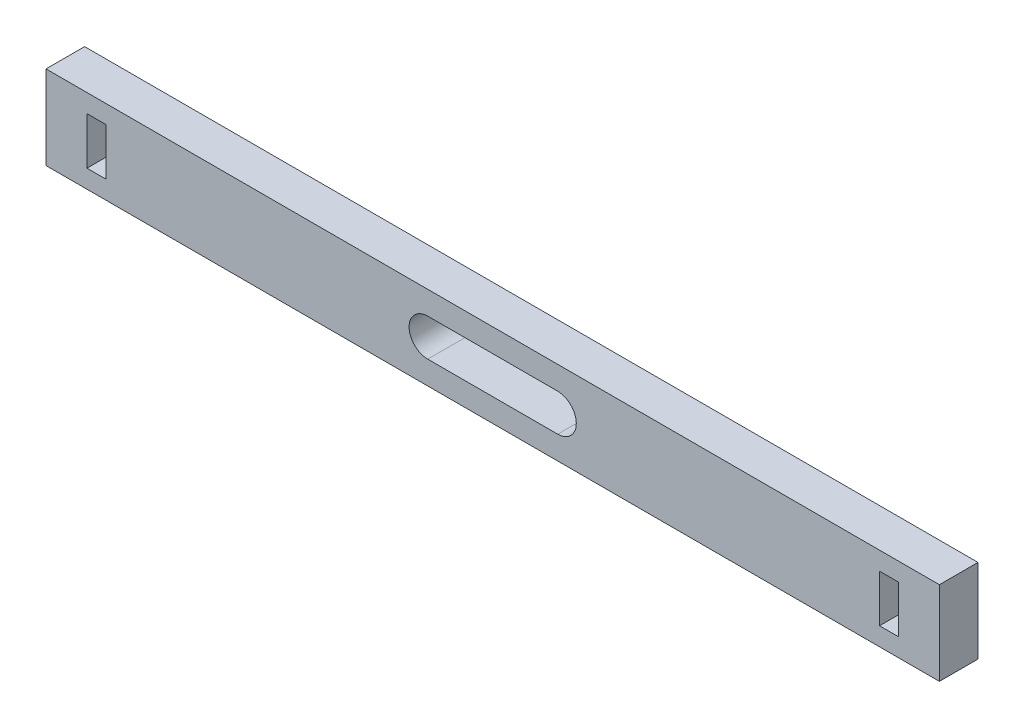
ISO-10303-21;
HEADER;
FILE_DESCRIPTION(('STEP AP214'),'2;1');
FILE_NAME('part.step','',(''),(''),'','','');
FILE_SCHEMA(('AUTOMOTIVE_DESIGN { 1 0 10303 214 1 1 1 1 }'));
ENDSEC;
DATA;
#1=APPLICATION_CONTEXT('core data for automotive mechanical design processes');
#2=APPLICATION_PROTOCOL_DEFINITION('international standard','automotive_design',2000,#1);
#3=PRODUCT_CONTEXT('',#1,'mechanical');
#4=PRODUCT('Part','Part','',(#3));
#5=PRODUCT_RELATED_PRODUCT_CATEGORY('part','',(#4));
#6=PRODUCT_DEFINITION_FORMATION('','',#4);
#7=PRODUCT_DEFINITION_CONTEXT('part definition',#1,'design');
#8=PRODUCT_DEFINITION('design','',#6,#7);
#9=PRODUCT_DEFINITION_SHAPE('','',#8);
#10=(LENGTH_UNIT() NAMED_UNIT(*) SI_UNIT(.MILLI.,.METRE.));
#11=(NAMED_UNIT(*) PLANE_ANGLE_UNIT() SI_UNIT($,.RADIAN.));
#12=(NAMED_UNIT(*) SI_UNIT($,.STERADIAN.) SOLID_ANGLE_UNIT());
#13=UNCERTAINTY_MEASURE_WITH_UNIT(LENGTH_MEASURE(1.E-05),#10,'distance_accuracy_value','');
#14=(GEOMETRIC_REPRESENTATION_CONTEXT(3) GLOBAL_UNCERTAINTY_ASSIGNED_CONTEXT((#13)) GLOBAL_UNIT_ASSIGNED_CONTEXT((#10,
#11,#12)) REPRESENTATION_CONTEXT('',''));
#15=CARTESIAN_POINT('',(0.,0.,0.));
#16=DIRECTION('',(0.,0.,1.));
#17=DIRECTION('',(1.,0.,0.));
#18=AXIS2_PLACEMENT_3D('',#15,#16,#17);
#19=CARTESIAN_POINT('',(0.,0.,3.1115));
#20=DIRECTION('',(0.,0.,-1.));
#21=DIRECTION('',(-1.,0.,0.));
#22=AXIS2_PLACEMENT_3D('',#19,#20,#21);
#23=PLANE('',#22);
#24=DIRECTION('',(0.,1.,0.));
#25=VECTOR('',#24,1.);
#26=CARTESIAN_POINT('',(-31.2086998005846,2.2454077279727,3.1115));
#27=LINE('',#26,#25);
#28=CARTESIAN_POINT('',(-31.2086998005846,-1.56459227202729,3.1115));
#29=VERTEX_POINT('',#28);
#30=CARTESIAN_POINT('',(-31.2086998005846,2.2454077279727,3.1115));
#31=VERTEX_POINT('',#30);
#32=EDGE_CURVE('E182',#29,#31,#27,.T.);
#33=ORIENTED_EDGE('',*,*,#32,.F.);
#34=DIRECTION('',(1.,0.,0.));
#35=VECTOR('',#34,1.);
#36=CARTESIAN_POINT('',(-32.7326998005846,-1.56459227202729,3.1115));
#37=LINE('',#36,#35);
#38=CARTESIAN_POINT('',(-32.7326998005846,-1.56459227202729,3.1115));
#39=VERTEX_POINT('',#38);
#40=EDGE_CURVE('E190',#39,#29,#37,.T.);
#41=ORIENTED_EDGE('',*,*,#40,.F.);
#42=DIRECTION('',(0.,-1.,0.));
#43=VECTOR('',#42,1.);
#44=CARTESIAN_POINT('',(-32.7326998005846,2.2454077279727,3.1115));
#45=LINE('',#44,#43);
#46=CARTESIAN_POINT('',(-32.7326998005846,2.2454077279727,3.1115));
#47=VERTEX_POINT('',#46);
#48=EDGE_CURVE('E187',#47,#39,#45,.T.);
#49=ORIENTED_EDGE('',*,*,#48,.F.);
#50=DIRECTION('',(-1.,0.,0.));
#51=VECTOR('',#50,1.);
#52=CARTESIAN_POINT('',(-32.7326998005846,2.2454077279727,3.1115));
#53=LINE('',#52,#51);
#54=EDGE_CURVE('E184',#31,#47,#53,.T.);
#55=ORIENTED_EDGE('',*,*,#54,.F.);
#56=EDGE_LOOP('',(#33,#41,#49,#55));
#57=FACE_BOUND('',#56,.T.);
#58=DIRECTION('',(0.,-1.,0.));
#59=VECTOR('',#58,1.);
#60=CARTESIAN_POINT('',(-36.0326998005846,-3.03406463952903,3.1115));
#61=LINE('',#60,#59);
#62=CARTESIAN_POINT('',(-36.0326998005846,3.71488009547444,3.1115));
#63=VERTEX_POINT('',#62);
#64=CARTESIAN_POINT('',(-36.0326998005846,-3.03406463952903,3.1115));
#65=VERTEX_POINT('',#64);
#66=EDGE_CURVE('E244',#63,#65,#61,.T.);
#67=ORIENTED_EDGE('',*,*,#66,.T.);
#68=DIRECTION('',(1.,0.,0.));
#69=VECTOR('',#68,1.);
#70=CARTESIAN_POINT('',(-36.0326998005846,-3.03406463952903,3.1115));
#71=LINE('',#70,#69);
#72=CARTESIAN_POINT('',(35.9673001994154,-3.03406463952903,3.1115));
#73=VERTEX_POINT('',#72);
#74=EDGE_CURVE('E247',#65,#73,#71,.T.);
#75=ORIENTED_EDGE('',*,*,#74,.T.);
#76=DIRECTION('',(0.,1.,0.));
#77=VECTOR('',#76,1.);
#78=CARTESIAN_POINT('',(35.9673001994154,-3.03406463952903,3.1115));
#79=LINE('',#78,#77);
#80=CARTESIAN_POINT('',(35.9673001994154,3.71488009547444,3.1115));
#81=VERTEX_POINT('',#80);
#82=EDGE_CURVE('E250',#73,#81,#79,.T.);
#83=ORIENTED_EDGE('',*,*,#82,.T.);
#84=DIRECTION('',(-1.,0.,0.));
#85=VECTOR('',#84,1.);
#86=CARTESIAN_POINT('',(-36.0326998005846,3.71488009547444,3.1115));
#87=LINE('',#86,#85);
#88=EDGE_CURVE('E252',#81,#63,#87,.T.);
#89=ORIENTED_EDGE('',*,*,#88,.T.);
#90=EDGE_LOOP('',(#67,#75,#83,#89));
#91=FACE_BOUND('',#90,.T.);
#92=DIRECTION('',(0.,1.,0.));
#93=VECTOR('',#92,1.);
#94=CARTESIAN_POINT('',(32.6673001994154,2.2454077279727,3.1115));
#95=LINE('',#94,#93);
#96=CARTESIAN_POINT('',(32.6673001994154,-1.56459227202729,3.1115));
#97=VERTEX_POINT('',#96);
#98=CARTESIAN_POINT('',(32.6673001994154,2.2454077279727,3.1115));
#99=VERTEX_POINT('',#98);
#100=EDGE_CURVE('E213',#97,#99,#95,.T.);
#101=ORIENTED_EDGE('',*,*,#100,.F.);
#102=DIRECTION('',(1.,0.,0.));
#103=VECTOR('',#102,1.);
#104=CARTESIAN_POINT('',(32.6673001994154,-1.56459227202729,3.1115));
#105=LINE('',#104,#103);
#106=CARTESIAN_POINT('',(31.1433001994154,-1.56459227202729,3.1115));
#107=VERTEX_POINT('',#106);
#108=EDGE_CURVE('E221',#107,#97,#105,.T.);
#109=ORIENTED_EDGE('',*,*,#108,.F.);
#110=DIRECTION('',(0.,-1.,0.));
#111=VECTOR('',#110,1.);
#112=CARTESIAN_POINT('',(31.1433001994154,2.2454077279727,3.1115));
#113=LINE('',#112,#111);
#114=CARTESIAN_POINT('',(31.1433001994154,2.2454077279727,3.1115));
#115=VERTEX_POINT('',#114);
#116=EDGE_CURVE('E218',#115,#107,#113,.T.);
#117=ORIENTED_EDGE('',*,*,#116,.F.);
#118=DIRECTION('',(-1.,0.,0.));
#119=VECTOR('',#118,1.);
#120=CARTESIAN_POINT('',(32.6673001994154,2.2454077279727,3.1115));
#121=LINE('',#120,#119);
#122=EDGE_CURVE('E215',#99,#115,#121,.T.);
#123=ORIENTED_EDGE('',*,*,#122,.F.);
#124=EDGE_LOOP('',(#101,#109,#117,#123));
#125=FACE_BOUND('',#124,.T.);
#126=CARTESIAN_POINT('',(-5.27007753997401,0.340407727972711,3.1115));
#127=DIRECTION('',(0.,0.,1.));
#128=DIRECTION('',(1.,0.,0.));
#129=AXIS2_PLACEMENT_3D('',#126,#127,#128);
#130=CIRCLE('',#129,1.5);
#131=CARTESIAN_POINT('',(-5.27007753997401,1.84040772797271,3.1115));
#132=VERTEX_POINT('',#131);
#133=CARTESIAN_POINT('',(-5.27007753997401,-1.15959227202729,3.1115));
#134=VERTEX_POINT('',#133);
#135=EDGE_CURVE('E146',#132,#134,#130,.T.);
#136=ORIENTED_EDGE('',*,*,#135,.F.);
#137=DIRECTION('',(-1.,0.,0.));
#138=VECTOR('',#137,1.);
#139=CARTESIAN_POINT('',(-5.27007753997401,1.84040772797271,3.1115));
#140=LINE('',#139,#138);
#141=CARTESIAN_POINT('',(5.20467793880482,1.84040772797273,3.1115));
#142=VERTEX_POINT('',#141);
#143=EDGE_CURVE('E168',#142,#132,#140,.T.);
#144=ORIENTED_EDGE('',*,*,#143,.F.);
#145=CARTESIAN_POINT('',(5.20467793880482,0.340407727972711,3.1115));
#146=DIRECTION('',(0.,0.,1.));
#147=DIRECTION('',(1.,0.,0.));
#148=AXIS2_PLACEMENT_3D('',#145,#146,#147);
#149=CIRCLE('',#148,1.50000000000002);
#150=CARTESIAN_POINT('',(5.20467793880482,-1.1595922720273,3.1115));
#151=VERTEX_POINT('',#150);
#152=EDGE_CURVE('E166',#151,#142,#149,.T.);
#153=ORIENTED_EDGE('',*,*,#152,.F.);
#154=DIRECTION('',(1.,0.,0.));
#155=VECTOR('',#154,1.);
#156=CARTESIAN_POINT('',(-5.27007753997401,-1.15959227202729,3.1115));
#157=LINE('',#156,#155);
#158=EDGE_CURVE('E154',#134,#151,#157,.T.);
#159=ORIENTED_EDGE('',*,*,#158,.F.);
#160=EDGE_LOOP('',(#136,#144,#153,#159));
#161=FACE_BOUND('',#160,.T.);
#162=ADVANCED_FACE('F33',(#57,#91,#125,#161),#23,.F.);
#163=CARTESIAN_POINT('',(0.,0.,0.));
#164=DIRECTION('',(0.,0.,-1.));
#165=DIRECTION('',(-1.,0.,0.));
#166=AXIS2_PLACEMENT_3D('',#163,#164,#165);
#167=PLANE('',#166);
#168=DIRECTION('',(1.,0.,0.));
#169=VECTOR('',#168,1.);
#170=CARTESIAN_POINT('',(-32.7326998005846,-1.56459227202729,0.));
#171=LINE('',#170,#169);
#172=CARTESIAN_POINT('',(-32.7326998005846,-1.56459227202729,0.));
#173=VERTEX_POINT('',#172);
#174=CARTESIAN_POINT('',(-31.2086998005846,-1.56459227202729,0.));
#175=VERTEX_POINT('',#174);
#176=EDGE_CURVE('E185',#173,#175,#171,.T.);
#177=ORIENTED_EDGE('',*,*,#176,.T.);
#178=DIRECTION('',(0.,1.,0.));
#179=VECTOR('',#178,1.);
#180=CARTESIAN_POINT('',(-31.2086998005846,2.2454077279727,0.));
#181=LINE('',#180,#179);
#182=CARTESIAN_POINT('',(-31.2086998005846,2.2454077279727,0.));
#183=VERTEX_POINT('',#182);
#184=EDGE_CURVE('E162',#175,#183,#181,.T.);
#185=ORIENTED_EDGE('',*,*,#184,.T.);
#186=DIRECTION('',(-1.,0.,0.));
#187=VECTOR('',#186,1.);
#188=CARTESIAN_POINT('',(-32.7326998005846,2.2454077279727,0.));
#189=LINE('',#188,#187);
#190=CARTESIAN_POINT('',(-32.7326998005846,2.2454077279727,0.));
#191=VERTEX_POINT('',#190);
#192=EDGE_CURVE('E195',#183,#191,#189,.T.);
#193=ORIENTED_EDGE('',*,*,#192,.T.);
#194=DIRECTION('',(0.,-1.,0.));
#195=VECTOR('',#194,1.);
#196=CARTESIAN_POINT('',(-32.7326998005846,2.2454077279727,0.));
#197=LINE('',#196,#195);
#198=EDGE_CURVE('E198',#191,#173,#197,.T.);
#199=ORIENTED_EDGE('',*,*,#198,.T.);
#200=EDGE_LOOP('',(#177,#185,#193,#199));
#201=FACE_BOUND('',#200,.T.);
#202=DIRECTION('',(0.,-1.,0.));
#203=VECTOR('',#202,1.);
#204=CARTESIAN_POINT('',(-36.0326998005846,-3.03406463952903,0.));
#205=LINE('',#204,#203);
#206=CARTESIAN_POINT('',(-36.0326998005846,3.71488009547444,0.));
#207=VERTEX_POINT('',#206);
#208=CARTESIAN_POINT('',(-36.0326998005846,-3.03406463952903,0.));
#209=VERTEX_POINT('',#208);
#210=EDGE_CURVE('E243',#207,#209,#205,.T.);
#211=ORIENTED_EDGE('',*,*,#210,.F.);
#212=DIRECTION('',(-1.,0.,0.));
#213=VECTOR('',#212,1.);
#214=CARTESIAN_POINT('',(-36.0326998005846,3.71488009547444,0.));
#215=LINE('',#214,#213);
#216=CARTESIAN_POINT('',(35.9673001994154,3.71488009547444,0.));
#217=VERTEX_POINT('',#216);
#218=EDGE_CURVE('E248',#217,#207,#215,.T.);
#219=ORIENTED_EDGE('',*,*,#218,.F.);
#220=DIRECTION('',(0.,1.,0.));
#221=VECTOR('',#220,1.);
#222=CARTESIAN_POINT('',(35.9673001994154,-3.03406463952903,0.));
#223=LINE('',#222,#221);
#224=CARTESIAN_POINT('',(35.9673001994154,-3.03406463952903,0.));
#225=VERTEX_POINT('',#224);
#226=EDGE_CURVE('E259',#225,#217,#223,.T.);
#227=ORIENTED_EDGE('',*,*,#226,.F.);
#228=DIRECTION('',(1.,0.,0.));
#229=VECTOR('',#228,1.);
#230=CARTESIAN_POINT('',(-36.0326998005846,-3.03406463952903,0.));
#231=LINE('',#230,#229);
#232=EDGE_CURVE('E257',#209,#225,#231,.T.);
#233=ORIENTED_EDGE('',*,*,#232,.F.);
#234=EDGE_LOOP('',(#211,#219,#227,#233));
#235=FACE_BOUND('',#234,.T.);
#236=DIRECTION('',(1.,0.,0.));
#237=VECTOR('',#236,1.);
#238=CARTESIAN_POINT('',(32.6673001994154,-1.56459227202729,0.));
#239=LINE('',#238,#237);
#240=CARTESIAN_POINT('',(31.1433001994154,-1.56459227202729,0.));
#241=VERTEX_POINT('',#240);
#242=CARTESIAN_POINT('',(32.6673001994154,-1.56459227202729,0.));
#243=VERTEX_POINT('',#242);
#244=EDGE_CURVE('E216',#241,#243,#239,.T.);
#245=ORIENTED_EDGE('',*,*,#244,.T.);
#246=DIRECTION('',(0.,1.,0.));
#247=VECTOR('',#246,1.);
#248=CARTESIAN_POINT('',(32.6673001994154,2.2454077279727,0.));
#249=LINE('',#248,#247);
#250=CARTESIAN_POINT('',(32.6673001994154,2.2454077279727,0.));
#251=VERTEX_POINT('',#250);
#252=EDGE_CURVE('E212',#243,#251,#249,.T.);
#253=ORIENTED_EDGE('',*,*,#252,.T.);
#254=DIRECTION('',(-1.,0.,0.));
#255=VECTOR('',#254,1.);
#256=CARTESIAN_POINT('',(32.6673001994154,2.2454077279727,0.));
#257=LINE('',#256,#255);
#258=CARTESIAN_POINT('',(31.1433001994154,2.2454077279727,0.));
#259=VERTEX_POINT('',#258);
#260=EDGE_CURVE('E226',#251,#259,#257,.T.);
#261=ORIENTED_EDGE('',*,*,#260,.T.);
#262=DIRECTION('',(0.,-1.,0.));
#263=VECTOR('',#262,1.);
#264=CARTESIAN_POINT('',(31.1433001994154,2.2454077279727,0.));
#265=LINE('',#264,#263);
#266=EDGE_CURVE('E229',#259,#241,#265,.T.);
#267=ORIENTED_EDGE('',*,*,#266,.T.);
#268=EDGE_LOOP('',(#245,#253,#261,#267));
#269=FACE_BOUND('',#268,.T.);
#270=DIRECTION('',(-1.,0.,0.));
#271=VECTOR('',#270,1.);
#272=CARTESIAN_POINT('',(-5.27007753997401,1.84040772797271,0.));
#273=LINE('',#272,#271);
#274=CARTESIAN_POINT('',(5.20467793880482,1.84040772797273,0.));
#275=VERTEX_POINT('',#274);
#276=CARTESIAN_POINT('',(-5.27007753997401,1.84040772797271,0.));
#277=VERTEX_POINT('',#276);
#278=EDGE_CURVE('E155',#275,#277,#273,.T.);
#279=ORIENTED_EDGE('',*,*,#278,.T.);
#280=CARTESIAN_POINT('',(-5.27007753997401,0.340407727972711,0.));
#281=DIRECTION('',(0.,0.,1.));
#282=DIRECTION('',(1.,0.,0.));
#283=AXIS2_PLACEMENT_3D('',#280,#281,#282);
#284=CIRCLE('',#283,1.5);
#285=CARTESIAN_POINT('',(-5.27007753997401,-1.15959227202729,0.));
#286=VERTEX_POINT('',#285);
#287=EDGE_CURVE('E56',#277,#286,#284,.T.);
#288=ORIENTED_EDGE('',*,*,#287,.T.);
#289=DIRECTION('',(1.,0.,0.));
#290=VECTOR('',#289,1.);
#291=CARTESIAN_POINT('',(-5.27007753997401,-1.15959227202729,0.));
#292=LINE('',#291,#290);
#293=CARTESIAN_POINT('',(5.20467793880482,-1.1595922720273,0.));
#294=VERTEX_POINT('',#293);
#295=EDGE_CURVE('E161',#286,#294,#292,.T.);
#296=ORIENTED_EDGE('',*,*,#295,.T.);
#297=CARTESIAN_POINT('',(5.20467793880482,0.340407727972711,0.));
#298=DIRECTION('',(0.,0.,1.));
#299=DIRECTION('',(1.,0.,0.));
#300=AXIS2_PLACEMENT_3D('',#297,#298,#299);
#301=CIRCLE('',#300,1.50000000000002);
#302=EDGE_CURVE('E174',#294,#275,#301,.T.);
#303=ORIENTED_EDGE('',*,*,#302,.T.);
#304=EDGE_LOOP('',(#279,#288,#296,#303));
#305=FACE_BOUND('',#304,.T.);
#306=ADVANCED_FACE('F277',(#201,#235,#269,#305),#167,.T.);
#307=CARTESIAN_POINT('',(-36.0326998005846,-3.03406463952903,3.1115));
#308=DIRECTION('',(1.,0.,0.));
#309=DIRECTION('',(0.,0.,-1.));
#310=AXIS2_PLACEMENT_3D('',#307,#308,#309);
#311=PLANE('',#310);
#312=ORIENTED_EDGE('',*,*,#210,.T.);
#313=DIRECTION('',(0.,0.,-1.));
#314=VECTOR('',#313,1.);
#315=CARTESIAN_POINT('',(-36.0326998005846,-3.03406463952903,3.1115));
#316=LINE('',#315,#314);
#317=EDGE_CURVE('E11',#65,#209,#316,.T.);
#318=ORIENTED_EDGE('',*,*,#317,.F.);
#319=ORIENTED_EDGE('',*,*,#66,.F.);
#320=DIRECTION('',(0.,0.,-1.));
#321=VECTOR('',#320,1.);
#322=CARTESIAN_POINT('',(-36.0326998005846,3.71488009547444,3.1115));
#323=LINE('',#322,#321);
#324=EDGE_CURVE('E254',#63,#207,#323,.T.);
#325=ORIENTED_EDGE('',*,*,#324,.T.);
#326=EDGE_LOOP('',(#312,#318,#319,#325));
#327=FACE_BOUND('',#326,.T.);
#328=ADVANCED_FACE('F35',(#327),#311,.F.);
#329=CARTESIAN_POINT('',(-36.0326998005846,-3.03406463952903,3.1115));
#330=DIRECTION('',(0.,1.,0.));
#331=DIRECTION('',(0.,0.,1.));
#332=AXIS2_PLACEMENT_3D('',#329,#330,#331);
#333=PLANE('',#332);
#334=ORIENTED_EDGE('',*,*,#232,.T.);
#335=DIRECTION('',(0.,0.,-1.));
#336=VECTOR('',#335,1.);
#337=CARTESIAN_POINT('',(35.9673001994154,-3.03406463952903,3.1115));
#338=LINE('',#337,#336);
#339=EDGE_CURVE('E41',#73,#225,#338,.T.);
#340=ORIENTED_EDGE('',*,*,#339,.F.);
#341=ORIENTED_EDGE('',*,*,#74,.F.);
#342=ORIENTED_EDGE('',*,*,#317,.T.);
#343=EDGE_LOOP('',(#334,#340,#341,#342));
#344=FACE_BOUND('',#343,.T.);
#345=ADVANCED_FACE('F288',(#344),#333,.F.);
#346=CARTESIAN_POINT('',(35.9673001994154,-3.03406463952903,3.1115));
#347=DIRECTION('',(-1.,0.,0.));
#348=DIRECTION('',(0.,0.,1.));
#349=AXIS2_PLACEMENT_3D('',#346,#347,#348);
#350=PLANE('',#349);
#351=ORIENTED_EDGE('',*,*,#226,.T.);
#352=DIRECTION('',(0.,0.,-1.));
#353=VECTOR('',#352,1.);
#354=CARTESIAN_POINT('',(35.9673001994154,3.71488009547444,3.1115));
#355=LINE('',#354,#353);
#356=EDGE_CURVE('E264',#81,#217,#355,.T.);
#357=ORIENTED_EDGE('',*,*,#356,.F.);
#358=ORIENTED_EDGE('',*,*,#82,.F.);
#359=ORIENTED_EDGE('',*,*,#339,.T.);
#360=EDGE_LOOP('',(#351,#357,#358,#359));
#361=FACE_BOUND('',#360,.T.);
#362=ADVANCED_FACE('F271',(#361),#350,.F.);
#363=CARTESIAN_POINT('',(-36.0326998005846,3.71488009547444,3.1115));
#364=DIRECTION('',(0.,-1.,0.));
#365=DIRECTION('',(0.,0.,-1.));
#366=AXIS2_PLACEMENT_3D('',#363,#364,#365);
#367=PLANE('',#366);
#368=ORIENTED_EDGE('',*,*,#218,.T.);
#369=ORIENTED_EDGE('',*,*,#324,.F.);
#370=ORIENTED_EDGE('',*,*,#88,.F.);
#371=ORIENTED_EDGE('',*,*,#356,.T.);
#372=EDGE_LOOP('',(#368,#369,#370,#371));
#373=FACE_BOUND('',#372,.T.);
#374=ADVANCED_FACE('F281',(#373),#367,.F.);
#375=CARTESIAN_POINT('',(32.6673001994154,2.2454077279727,3.1115));
#376=DIRECTION('',(-1.,0.,0.));
#377=DIRECTION('',(0.,0.,1.));
#378=AXIS2_PLACEMENT_3D('',#375,#376,#377);
#379=PLANE('',#378);
#380=ORIENTED_EDGE('',*,*,#252,.F.);
#381=DIRECTION('',(0.,0.,-1.));
#382=VECTOR('',#381,1.);
#383=CARTESIAN_POINT('',(32.6673001994154,-1.56459227202729,3.1115));
#384=LINE('',#383,#382);
#385=EDGE_CURVE('E223',#97,#243,#384,.T.);
#386=ORIENTED_EDGE('',*,*,#385,.F.);
#387=ORIENTED_EDGE('',*,*,#100,.T.);
#388=DIRECTION('',(0.,0.,-1.));
#389=VECTOR('',#388,1.);
#390=CARTESIAN_POINT('',(32.6673001994154,2.2454077279727,3.1115));
#391=LINE('',#390,#389);
#392=EDGE_CURVE('E240',#99,#251,#391,.T.);
#393=ORIENTED_EDGE('',*,*,#392,.T.);
#394=EDGE_LOOP('',(#380,#386,#387,#393));
#395=FACE_BOUND('',#394,.T.);
#396=ADVANCED_FACE('F305',(#395),#379,.T.);
#397=CARTESIAN_POINT('',(32.6673001994154,2.2454077279727,3.1115));
#398=DIRECTION('',(0.,-1.,0.));
#399=DIRECTION('',(0.,0.,-1.));
#400=AXIS2_PLACEMENT_3D('',#397,#398,#399);
#401=PLANE('',#400);
#402=ORIENTED_EDGE('',*,*,#260,.F.);
#403=ORIENTED_EDGE('',*,*,#392,.F.);
#404=ORIENTED_EDGE('',*,*,#122,.T.);
#405=DIRECTION('',(0.,0.,-1.));
#406=VECTOR('',#405,1.);
#407=CARTESIAN_POINT('',(31.1433001994154,2.2454077279727,3.1115));
#408=LINE('',#407,#406);
#409=EDGE_CURVE('E238',#115,#259,#408,.T.);
#410=ORIENTED_EDGE('',*,*,#409,.T.);
#411=EDGE_LOOP('',(#402,#403,#404,#410));
#412=FACE_BOUND('',#411,.T.);
#413=ADVANCED_FACE('F312',(#412),#401,.T.);
#414=CARTESIAN_POINT('',(31.1433001994154,2.2454077279727,3.1115));
#415=DIRECTION('',(1.,0.,0.));
#416=DIRECTION('',(0.,0.,-1.));
#417=AXIS2_PLACEMENT_3D('',#414,#415,#416);
#418=PLANE('',#417);
#419=ORIENTED_EDGE('',*,*,#266,.F.);
#420=ORIENTED_EDGE('',*,*,#409,.F.);
#421=ORIENTED_EDGE('',*,*,#116,.T.);
#422=DIRECTION('',(0.,0.,-1.));
#423=VECTOR('',#422,1.);
#424=CARTESIAN_POINT('',(31.1433001994154,-1.56459227202729,3.1115));
#425=LINE('',#424,#423);
#426=EDGE_CURVE('E236',#107,#241,#425,.T.);
#427=ORIENTED_EDGE('',*,*,#426,.T.);
#428=EDGE_LOOP('',(#419,#420,#421,#427));
#429=FACE_BOUND('',#428,.T.);
#430=ADVANCED_FACE('F317',(#429),#418,.T.);
#431=CARTESIAN_POINT('',(32.6673001994154,-1.56459227202729,3.1115));
#432=DIRECTION('',(0.,1.,0.));
#433=DIRECTION('',(0.,0.,1.));
#434=AXIS2_PLACEMENT_3D('',#431,#432,#433);
#435=PLANE('',#434);
#436=ORIENTED_EDGE('',*,*,#244,.F.);
#437=ORIENTED_EDGE('',*,*,#426,.F.);
#438=ORIENTED_EDGE('',*,*,#108,.T.);
#439=ORIENTED_EDGE('',*,*,#385,.T.);
#440=EDGE_LOOP('',(#436,#437,#438,#439));
#441=FACE_BOUND('',#440,.T.);
#442=ADVANCED_FACE('F324',(#441),#435,.T.);
#443=CARTESIAN_POINT('',(-31.2086998005846,2.2454077279727,3.1115));
#444=DIRECTION('',(-1.,0.,0.));
#445=DIRECTION('',(0.,-1.,0.));
#446=AXIS2_PLACEMENT_3D('',#443,#444,#445);
#447=PLANE('',#446);
#448=ORIENTED_EDGE('',*,*,#184,.F.);
#449=DIRECTION('',(0.,0.,-1.));
#450=VECTOR('',#449,1.);
#451=CARTESIAN_POINT('',(-31.2086998005846,-1.56459227202729,3.1115));
#452=LINE('',#451,#450);
#453=EDGE_CURVE('E192',#29,#175,#452,.T.);
#454=ORIENTED_EDGE('',*,*,#453,.F.);
#455=ORIENTED_EDGE('',*,*,#32,.T.);
#456=DIRECTION('',(0.,0.,-1.));
#457=VECTOR('',#456,1.);
#458=CARTESIAN_POINT('',(-31.2086998005846,2.2454077279727,3.1115));
#459=LINE('',#458,#457);
#460=EDGE_CURVE('E209',#31,#183,#459,.T.);
#461=ORIENTED_EDGE('',*,*,#460,.T.);
#462=EDGE_LOOP('',(#448,#454,#455,#461));
#463=FACE_BOUND('',#462,.T.);
#464=ADVANCED_FACE('F337',(#463),#447,.T.);
#465=CARTESIAN_POINT('',(-32.7326998005846,2.2454077279727,3.1115));
#466=DIRECTION('',(0.,-1.,0.));
#467=DIRECTION('',(0.,0.,-1.));
#468=AXIS2_PLACEMENT_3D('',#465,#466,#467);
#469=PLANE('',#468);
#470=ORIENTED_EDGE('',*,*,#192,.F.);
#471=ORIENTED_EDGE('',*,*,#460,.F.);
#472=ORIENTED_EDGE('',*,*,#54,.T.);
#473=DIRECTION('',(0.,0.,-1.));
#474=VECTOR('',#473,1.);
#475=CARTESIAN_POINT('',(-32.7326998005846,2.2454077279727,3.1115));
#476=LINE('',#475,#474);
#477=EDGE_CURVE('E207',#47,#191,#476,.T.);
#478=ORIENTED_EDGE('',*,*,#477,.T.);
#479=EDGE_LOOP('',(#470,#471,#472,#478));
#480=FACE_BOUND('',#479,.T.);
#481=ADVANCED_FACE('F342',(#480),#469,.T.);
#482=CARTESIAN_POINT('',(-32.7326998005846,2.2454077279727,3.1115));
#483=DIRECTION('',(1.,0.,0.));
#484=DIRECTION('',(0.,0.,-1.));
#485=AXIS2_PLACEMENT_3D('',#482,#483,#484);
#486=PLANE('',#485);
#487=ORIENTED_EDGE('',*,*,#198,.F.);
#488=ORIENTED_EDGE('',*,*,#477,.F.);
#489=ORIENTED_EDGE('',*,*,#48,.T.);
#490=DIRECTION('',(0.,0.,-1.));
#491=VECTOR('',#490,1.);
#492=CARTESIAN_POINT('',(-32.7326998005846,-1.56459227202729,3.1115));
#493=LINE('',#492,#491);
#494=EDGE_CURVE('E205',#39,#173,#493,.T.);
#495=ORIENTED_EDGE('',*,*,#494,.T.);
#496=EDGE_LOOP('',(#487,#488,#489,#495));
#497=FACE_BOUND('',#496,.T.);
#498=ADVANCED_FACE('F346',(#497),#486,.T.);
#499=CARTESIAN_POINT('',(-32.7326998005846,-1.56459227202729,3.1115));
#500=DIRECTION('',(0.,1.,0.));
#501=DIRECTION('',(0.,0.,1.));
#502=AXIS2_PLACEMENT_3D('',#499,#500,#501);
#503=PLANE('',#502);
#504=ORIENTED_EDGE('',*,*,#176,.F.);
#505=ORIENTED_EDGE('',*,*,#494,.F.);
#506=ORIENTED_EDGE('',*,*,#40,.T.);
#507=ORIENTED_EDGE('',*,*,#453,.T.);
#508=EDGE_LOOP('',(#504,#505,#506,#507));
#509=FACE_BOUND('',#508,.T.);
#510=ADVANCED_FACE('F350',(#509),#503,.T.);
#511=CARTESIAN_POINT('',(-5.27007753997401,0.340407727972711,3.1115));
#512=DIRECTION('',(0.,0.,-1.));
#513=DIRECTION('',(-1.,0.,0.));
#514=AXIS2_PLACEMENT_3D('',#511,#512,#513);
#515=CYLINDRICAL_SURFACE('',#514,1.5);
#516=ORIENTED_EDGE('',*,*,#287,.F.);
#517=DIRECTION('',(0.,0.,-1.));
#518=VECTOR('',#517,1.);
#519=CARTESIAN_POINT('',(-5.27007753997401,1.84040772797271,3.1115));
#520=LINE('',#519,#518);
#521=EDGE_CURVE('E150',#132,#277,#520,.T.);
#522=ORIENTED_EDGE('',*,*,#521,.F.);
#523=ORIENTED_EDGE('',*,*,#135,.T.);
#524=DIRECTION('',(0.,0.,-1.));
#525=VECTOR('',#524,1.);
#526=CARTESIAN_POINT('',(-5.27007753997401,-1.15959227202729,3.1115));
#527=LINE('',#526,#525);
#528=EDGE_CURVE('E149',#134,#286,#527,.T.);
#529=ORIENTED_EDGE('',*,*,#528,.T.);
#530=EDGE_LOOP('',(#516,#522,#523,#529));
#531=FACE_BOUND('',#530,.T.);
#532=ADVANCED_FACE('F148',(#531),#515,.F.);
#533=CARTESIAN_POINT('',(-5.27007753997401,-1.15959227202729,3.1115));
#534=DIRECTION('',(0.,1.,0.));
#535=DIRECTION('',(-1.,0.,0.));
#536=AXIS2_PLACEMENT_3D('',#533,#534,#535);
#537=PLANE('',#536);
#538=ORIENTED_EDGE('',*,*,#295,.F.);
#539=ORIENTED_EDGE('',*,*,#528,.F.);
#540=ORIENTED_EDGE('',*,*,#158,.T.);
#541=DIRECTION('',(0.,0.,-1.));
#542=VECTOR('',#541,1.);
#543=CARTESIAN_POINT('',(5.20467793880482,-1.1595922720273,3.1115));
#544=LINE('',#543,#542);
#545=EDGE_CURVE('E163',#151,#294,#544,.T.);
#546=ORIENTED_EDGE('',*,*,#545,.T.);
#547=EDGE_LOOP('',(#538,#539,#540,#546));
#548=FACE_BOUND('',#547,.T.);
#549=ADVANCED_FACE('F158',(#548),#537,.T.);
#550=CARTESIAN_POINT('',(5.20467793880482,0.340407727972711,3.1115));
#551=DIRECTION('',(0.,0.,-1.));
#552=DIRECTION('',(-1.,0.,0.));
#553=AXIS2_PLACEMENT_3D('',#550,#551,#552);
#554=CYLINDRICAL_SURFACE('',#553,1.50000000000002);
#555=ORIENTED_EDGE('',*,*,#302,.F.);
#556=ORIENTED_EDGE('',*,*,#545,.F.);
#557=ORIENTED_EDGE('',*,*,#152,.T.);
#558=DIRECTION('',(0.,0.,-1.));
#559=VECTOR('',#558,1.);
#560=CARTESIAN_POINT('',(5.20467793880482,1.84040772797273,3.1115));
#561=LINE('',#560,#559);
#562=EDGE_CURVE('E48',#142,#275,#561,.T.);
#563=ORIENTED_EDGE('',*,*,#562,.T.);
#564=EDGE_LOOP('',(#555,#556,#557,#563));
#565=FACE_BOUND('',#564,.T.);
#566=ADVANCED_FACE('F359',(#565),#554,.F.);
#567=CARTESIAN_POINT('',(-5.27007753997401,1.84040772797271,3.1115));
#568=DIRECTION('',(0.,-1.,0.));
#569=DIRECTION('',(1.,0.,0.));
#570=AXIS2_PLACEMENT_3D('',#567,#568,#569);
#571=PLANE('',#570);
#572=ORIENTED_EDGE('',*,*,#278,.F.);
#573=ORIENTED_EDGE('',*,*,#562,.F.);
#574=ORIENTED_EDGE('',*,*,#143,.T.);
#575=ORIENTED_EDGE('',*,*,#521,.T.);
#576=EDGE_LOOP('',(#572,#573,#574,#575));
#577=FACE_BOUND('',#576,.T.);
#578=ADVANCED_FACE('F362',(#577),#571,.T.);
#579=CLOSED_SHELL('',(#162,#306,#328,#345,#362,#374,#396,#413,#430,#442,#464,#481,#498,#510,
#532,#549,#566,#578));
#580=MANIFOLD_SOLID_BREP('B2',#579);
#581=ADVANCED_BREP_SHAPE_REPRESENTATION('',(#18,#580),#14);
#582=SHAPE_DEFINITION_REPRESENTATION(#9,#581);
ENDSEC;
END-ISO-10303-21;
